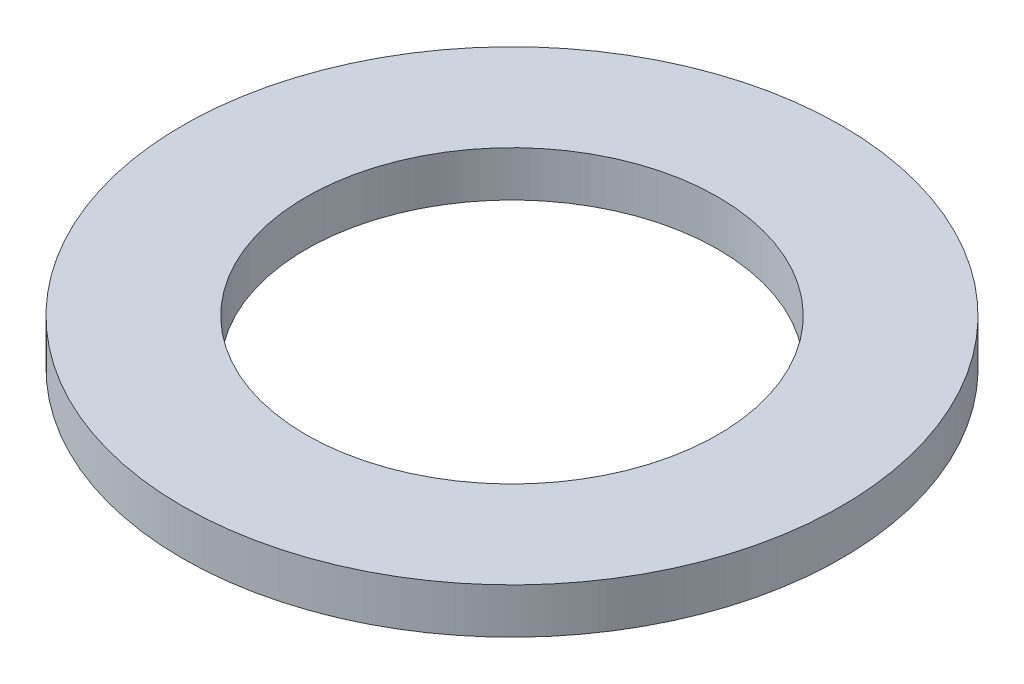
ISO-10303-21;
HEADER;
FILE_DESCRIPTION(('STEP AP214'),'2;1');
FILE_NAME('part.step','',(''),(''),'','','');
FILE_SCHEMA(('AUTOMOTIVE_DESIGN { 1 0 10303 214 1 1 1 1 }'));
ENDSEC;
DATA;
#1=APPLICATION_CONTEXT('core data for automotive mechanical design processes');
#2=APPLICATION_PROTOCOL_DEFINITION('international standard','automotive_design',2000,#1);
#3=PRODUCT_CONTEXT('',#1,'mechanical');
#4=PRODUCT('Part','Part','',(#3));
#5=PRODUCT_RELATED_PRODUCT_CATEGORY('part','',(#4));
#6=PRODUCT_DEFINITION_FORMATION('','',#4);
#7=PRODUCT_DEFINITION_CONTEXT('part definition',#1,'design');
#8=PRODUCT_DEFINITION('design','',#6,#7);
#9=PRODUCT_DEFINITION_SHAPE('','',#8);
#10=(LENGTH_UNIT() NAMED_UNIT(*) SI_UNIT(.MILLI.,.METRE.));
#11=(NAMED_UNIT(*) PLANE_ANGLE_UNIT() SI_UNIT($,.RADIAN.));
#12=(NAMED_UNIT(*) SI_UNIT($,.STERADIAN.) SOLID_ANGLE_UNIT());
#13=UNCERTAINTY_MEASURE_WITH_UNIT(LENGTH_MEASURE(1.E-05),#10,'distance_accuracy_value','');
#14=(GEOMETRIC_REPRESENTATION_CONTEXT(3) GLOBAL_UNCERTAINTY_ASSIGNED_CONTEXT((#13)) GLOBAL_UNIT_ASSIGNED_CONTEXT((#10,
#11,#12)) REPRESENTATION_CONTEXT('',''));
#15=CARTESIAN_POINT('',(0.,0.,0.));
#16=DIRECTION('',(0.,0.,1.));
#17=DIRECTION('',(1.,0.,0.));
#18=AXIS2_PLACEMENT_3D('',#15,#16,#17);
#19=CARTESIAN_POINT('',(0.,11.,0.));
#20=DIRECTION('',(0.,-1.,0.));
#21=DIRECTION('',(0.,0.,-1.));
#22=AXIS2_PLACEMENT_3D('',#19,#20,#21);
#23=CYLINDRICAL_SURFACE('',#22,80.);
#24=CARTESIAN_POINT('',(0.,11.,0.));
#25=DIRECTION('',(0.,1.,0.));
#26=DIRECTION('',(0.,0.,1.));
#27=AXIS2_PLACEMENT_3D('',#24,#25,#26);
#28=CIRCLE('',#27,80.);
#29=CARTESIAN_POINT('',(0.,11.,80.));
#30=VERTEX_POINT('',#29);
#31=EDGE_CURVE('E10',#30,#30,#28,.T.);
#32=ORIENTED_EDGE('',*,*,#31,.F.);
#33=EDGE_LOOP('',(#32));
#34=FACE_BOUND('',#33,.T.);
#35=CARTESIAN_POINT('',(0.,0.,0.));
#36=DIRECTION('',(0.,1.,0.));
#37=DIRECTION('',(0.,0.,1.));
#38=AXIS2_PLACEMENT_3D('',#35,#36,#37);
#39=CIRCLE('',#38,80.);
#40=CARTESIAN_POINT('',(0.,0.,80.));
#41=VERTEX_POINT('',#40);
#42=EDGE_CURVE('E37',#41,#41,#39,.T.);
#43=ORIENTED_EDGE('',*,*,#42,.T.);
#44=EDGE_LOOP('',(#43));
#45=FACE_BOUND('',#44,.T.);
#46=ADVANCED_FACE('F40',(#34,#45),#23,.T.);
#47=CARTESIAN_POINT('',(0.,11.,0.));
#48=DIRECTION('',(0.,1.,0.));
#49=DIRECTION('',(0.,0.,1.));
#50=AXIS2_PLACEMENT_3D('',#47,#48,#49);
#51=PLANE('',#50);
#52=CARTESIAN_POINT('',(0.,11.,0.));
#53=DIRECTION('',(0.,1.,0.));
#54=DIRECTION('',(0.,0.,1.));
#55=AXIS2_PLACEMENT_3D('',#52,#53,#54);
#56=CIRCLE('',#55,50.);
#57=CARTESIAN_POINT('',(0.,11.,50.));
#58=VERTEX_POINT('',#57);
#59=EDGE_CURVE('E50',#58,#58,#56,.T.);
#60=ORIENTED_EDGE('',*,*,#59,.F.);
#61=EDGE_LOOP('',(#60));
#62=FACE_BOUND('',#61,.T.);
#63=ORIENTED_EDGE('',*,*,#31,.T.);
#64=EDGE_LOOP('',(#63));
#65=FACE_BOUND('',#64,.T.);
#66=ADVANCED_FACE('F59',(#62,#65),#51,.T.);
#67=CARTESIAN_POINT('',(0.,0.,0.));
#68=DIRECTION('',(0.,1.,0.));
#69=DIRECTION('',(0.,0.,1.));
#70=AXIS2_PLACEMENT_3D('',#67,#68,#69);
#71=PLANE('',#70);
#72=CARTESIAN_POINT('',(0.,0.,0.));
#73=DIRECTION('',(0.,1.,0.));
#74=DIRECTION('',(0.,0.,1.));
#75=AXIS2_PLACEMENT_3D('',#72,#73,#74);
#76=CIRCLE('',#75,50.);
#77=CARTESIAN_POINT('',(0.,0.,50.));
#78=VERTEX_POINT('',#77);
#79=EDGE_CURVE('E47',#78,#78,#76,.T.);
#80=ORIENTED_EDGE('',*,*,#79,.T.);
#81=EDGE_LOOP('',(#80));
#82=FACE_BOUND('',#81,.T.);
#83=ORIENTED_EDGE('',*,*,#42,.F.);
#84=EDGE_LOOP('',(#83));
#85=FACE_BOUND('',#84,.T.);
#86=ADVANCED_FACE('F58',(#82,#85),#71,.F.);
#87=CARTESIAN_POINT('',(0.,11.,0.));
#88=DIRECTION('',(0.,-1.,0.));
#89=DIRECTION('',(0.,0.,-1.));
#90=AXIS2_PLACEMENT_3D('',#87,#88,#89);
#91=CYLINDRICAL_SURFACE('',#90,50.);
#92=ORIENTED_EDGE('',*,*,#59,.T.);
#93=EDGE_LOOP('',(#92));
#94=FACE_BOUND('',#93,.T.);
#95=ORIENTED_EDGE('',*,*,#79,.F.);
#96=EDGE_LOOP('',(#95));
#97=FACE_BOUND('',#96,.T.);
#98=ADVANCED_FACE('F54',(#94,#97),#91,.F.);
#99=CLOSED_SHELL('',(#46,#66,#86,#98));
#100=MANIFOLD_SOLID_BREP('B2',#99);
#101=ADVANCED_BREP_SHAPE_REPRESENTATION('',(#18,#100),#14);
#102=SHAPE_DEFINITION_REPRESENTATION(#9,#101);
ENDSEC;
END-ISO-10303-21;
